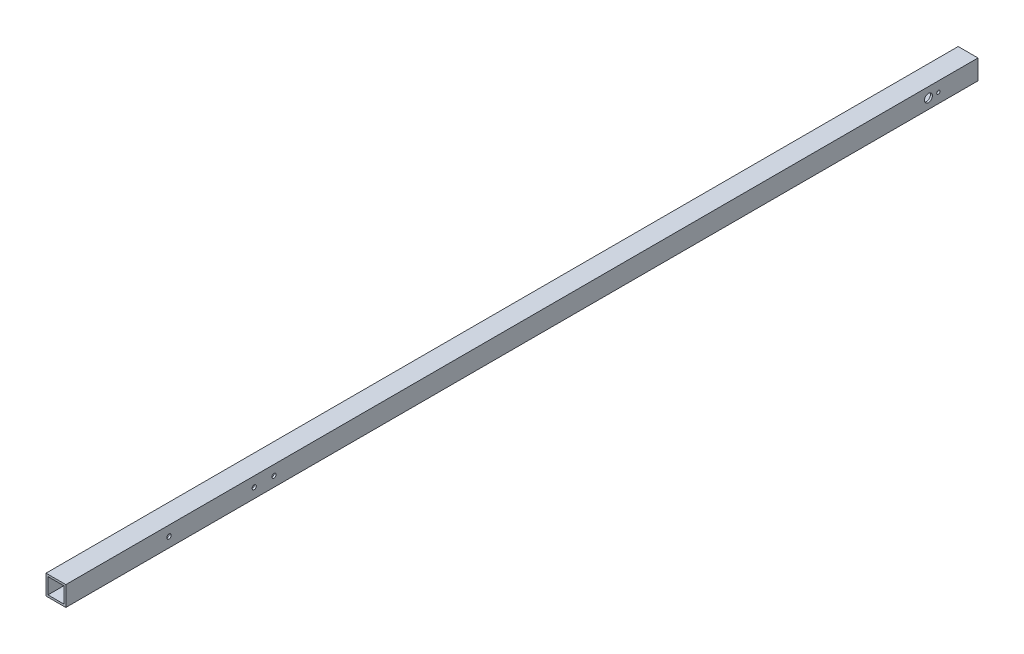
ISO-10303-21;
HEADER;
FILE_DESCRIPTION(('STEP AP214'),'2;1');
FILE_NAME('part.step','',(''),(''),'','','');
FILE_SCHEMA(('AUTOMOTIVE_DESIGN { 1 0 10303 214 1 1 1 1 }'));
ENDSEC;
DATA;
#1=APPLICATION_CONTEXT('core data for automotive mechanical design processes');
#2=APPLICATION_PROTOCOL_DEFINITION('international standard','automotive_design',2000,#1);
#3=PRODUCT_CONTEXT('',#1,'mechanical');
#4=PRODUCT('Part','Part','',(#3));
#5=PRODUCT_RELATED_PRODUCT_CATEGORY('part','',(#4));
#6=PRODUCT_DEFINITION_FORMATION('','',#4);
#7=PRODUCT_DEFINITION_CONTEXT('part definition',#1,'design');
#8=PRODUCT_DEFINITION('design','',#6,#7);
#9=PRODUCT_DEFINITION_SHAPE('','',#8);
#10=(LENGTH_UNIT() NAMED_UNIT(*) SI_UNIT(.MILLI.,.METRE.));
#11=(NAMED_UNIT(*) PLANE_ANGLE_UNIT() SI_UNIT($,.RADIAN.));
#12=(NAMED_UNIT(*) SI_UNIT($,.STERADIAN.) SOLID_ANGLE_UNIT());
#13=UNCERTAINTY_MEASURE_WITH_UNIT(LENGTH_MEASURE(1.E-05),#10,'distance_accuracy_value','');
#14=(GEOMETRIC_REPRESENTATION_CONTEXT(3) GLOBAL_UNCERTAINTY_ASSIGNED_CONTEXT((#13)) GLOBAL_UNIT_ASSIGNED_CONTEXT((#10,
#11,#12)) REPRESENTATION_CONTEXT('',''));
#15=CARTESIAN_POINT('',(0.,0.,0.));
#16=DIRECTION('',(0.,0.,1.));
#17=DIRECTION('',(1.,0.,0.));
#18=AXIS2_PLACEMENT_3D('',#15,#16,#17);
#19=CARTESIAN_POINT('',(0.,0.,0.));
#20=DIRECTION('',(0.,0.,1.));
#21=DIRECTION('',(1.,0.,0.));
#22=AXIS2_PLACEMENT_3D('',#19,#20,#21);
#23=PLANE('',#22);
#24=DIRECTION('',(0.,1.,0.));
#25=VECTOR('',#24,1.);
#26=CARTESIAN_POINT('',(10.,10.,0.));
#27=LINE('',#26,#25);
#28=CARTESIAN_POINT('',(10.,-10.,0.));
#29=VERTEX_POINT('',#28);
#30=CARTESIAN_POINT('',(10.,10.,0.));
#31=VERTEX_POINT('',#30);
#32=EDGE_CURVE('E127',#29,#31,#27,.T.);
#33=ORIENTED_EDGE('',*,*,#32,.F.);
#34=DIRECTION('',(1.,0.,0.));
#35=VECTOR('',#34,1.);
#36=CARTESIAN_POINT('',(-10.,-10.,0.));
#37=LINE('',#36,#35);
#38=CARTESIAN_POINT('',(-10.,-10.,0.));
#39=VERTEX_POINT('',#38);
#40=EDGE_CURVE('E136',#39,#29,#37,.T.);
#41=ORIENTED_EDGE('',*,*,#40,.F.);
#42=DIRECTION('',(0.,-1.,0.));
#43=VECTOR('',#42,1.);
#44=CARTESIAN_POINT('',(-10.,10.,0.));
#45=LINE('',#44,#43);
#46=CARTESIAN_POINT('',(-10.,10.,0.));
#47=VERTEX_POINT('',#46);
#48=EDGE_CURVE('E133',#47,#39,#45,.T.);
#49=ORIENTED_EDGE('',*,*,#48,.F.);
#50=DIRECTION('',(-1.,0.,0.));
#51=VECTOR('',#50,1.);
#52=CARTESIAN_POINT('',(-10.,10.,0.));
#53=LINE('',#52,#51);
#54=EDGE_CURVE('E130',#31,#47,#53,.T.);
#55=ORIENTED_EDGE('',*,*,#54,.F.);
#56=EDGE_LOOP('',(#33,#41,#49,#55));
#57=FACE_BOUND('',#56,.T.);
#58=DIRECTION('',(0.,1.,0.));
#59=VECTOR('',#58,1.);
#60=CARTESIAN_POINT('',(8.,8.,0.));
#61=LINE('',#60,#59);
#62=CARTESIAN_POINT('',(8.,-8.,0.));
#63=VERTEX_POINT('',#62);
#64=CARTESIAN_POINT('',(8.,8.,0.));
#65=VERTEX_POINT('',#64);
#66=EDGE_CURVE('E217',#63,#65,#61,.T.);
#67=ORIENTED_EDGE('',*,*,#66,.T.);
#68=DIRECTION('',(-1.,0.,0.));
#69=VECTOR('',#68,1.);
#70=CARTESIAN_POINT('',(-8.,8.,0.));
#71=LINE('',#70,#69);
#72=CARTESIAN_POINT('',(-8.,8.,0.));
#73=VERTEX_POINT('',#72);
#74=EDGE_CURVE('E220',#65,#73,#71,.T.);
#75=ORIENTED_EDGE('',*,*,#74,.T.);
#76=DIRECTION('',(0.,-1.,0.));
#77=VECTOR('',#76,1.);
#78=CARTESIAN_POINT('',(-8.,8.,0.));
#79=LINE('',#78,#77);
#80=CARTESIAN_POINT('',(-8.,-8.,0.));
#81=VERTEX_POINT('',#80);
#82=EDGE_CURVE('E223',#73,#81,#79,.T.);
#83=ORIENTED_EDGE('',*,*,#82,.T.);
#84=DIRECTION('',(1.,0.,0.));
#85=VECTOR('',#84,1.);
#86=CARTESIAN_POINT('',(-8.,-8.,0.));
#87=LINE('',#86,#85);
#88=EDGE_CURVE('E117',#81,#63,#87,.T.);
#89=ORIENTED_EDGE('',*,*,#88,.T.);
#90=EDGE_LOOP('',(#67,#75,#83,#89));
#91=FACE_BOUND('',#90,.T.);
#92=ADVANCED_FACE('F34',(#57,#91),#23,.F.);
#93=CARTESIAN_POINT('',(10.,10.,970.));
#94=DIRECTION('',(-1.,0.,0.));
#95=DIRECTION('',(0.,0.,1.));
#96=AXIS2_PLACEMENT_3D('',#93,#94,#95);
#97=PLANE('',#96);
#98=CARTESIAN_POINT('',(10.,0.,710.));
#99=DIRECTION('',(1.,0.,0.));
#100=DIRECTION('',(0.,0.,-1.));
#101=AXIS2_PLACEMENT_3D('',#98,#99,#100);
#102=CIRCLE('',#101,2.10000000000004);
#103=CARTESIAN_POINT('',(10.,0.,707.9));
#104=VERTEX_POINT('',#103);
#105=EDGE_CURVE('E465',#104,#104,#102,.T.);
#106=ORIENTED_EDGE('',*,*,#105,.F.);
#107=EDGE_LOOP('',(#106));
#108=FACE_BOUND('',#107,.T.);
#109=CARTESIAN_POINT('',(10.,0.,730.));
#110=DIRECTION('',(1.,0.,0.));
#111=DIRECTION('',(0.,0.,-1.));
#112=AXIS2_PLACEMENT_3D('',#109,#110,#111);
#113=CIRCLE('',#112,2.10000000000004);
#114=CARTESIAN_POINT('',(10.,0.,727.9));
#115=VERTEX_POINT('',#114);
#116=EDGE_CURVE('E173',#115,#115,#113,.T.);
#117=ORIENTED_EDGE('',*,*,#116,.F.);
#118=EDGE_LOOP('',(#117));
#119=FACE_BOUND('',#118,.T.);
#120=CARTESIAN_POINT('',(10.,0.,40.));
#121=DIRECTION('',(1.,0.,0.));
#122=DIRECTION('',(0.,0.,-1.));
#123=AXIS2_PLACEMENT_3D('',#120,#121,#122);
#124=CIRCLE('',#123,1.64999999999999);
#125=CARTESIAN_POINT('',(10.,0.,38.35));
#126=VERTEX_POINT('',#125);
#127=EDGE_CURVE('E166',#126,#126,#124,.T.);
#128=ORIENTED_EDGE('',*,*,#127,.F.);
#129=EDGE_LOOP('',(#128));
#130=FACE_BOUND('',#129,.T.);
#131=CARTESIAN_POINT('',(10.,0.,816.));
#132=DIRECTION('',(1.,0.,0.));
#133=DIRECTION('',(0.,0.,-1.));
#134=AXIS2_PLACEMENT_3D('',#131,#132,#133);
#135=CIRCLE('',#134,2.19999999999998);
#136=CARTESIAN_POINT('',(10.,0.,813.8));
#137=VERTEX_POINT('',#136);
#138=EDGE_CURVE('E155',#137,#137,#135,.T.);
#139=ORIENTED_EDGE('',*,*,#138,.F.);
#140=EDGE_LOOP('',(#139));
#141=FACE_BOUND('',#140,.T.);
#142=CARTESIAN_POINT('',(10.,0.,49.9999999999999));
#143=DIRECTION('',(1.,0.,0.));
#144=DIRECTION('',(0.,0.,-1.));
#145=AXIS2_PLACEMENT_3D('',#142,#143,#144);
#146=CIRCLE('',#145,4.05);
#147=CARTESIAN_POINT('',(10.,0.,45.9499999999999));
#148=VERTEX_POINT('',#147);
#149=EDGE_CURVE('E210',#148,#148,#146,.T.);
#150=ORIENTED_EDGE('',*,*,#149,.F.);
#151=EDGE_LOOP('',(#150));
#152=FACE_BOUND('',#151,.T.);
#153=DIRECTION('',(0.,0.,-1.));
#154=VECTOR('',#153,1.);
#155=CARTESIAN_POINT('',(10.,10.,970.));
#156=LINE('',#155,#154);
#157=CARTESIAN_POINT('',(10.,10.,920.));
#158=VERTEX_POINT('',#157);
#159=EDGE_CURVE('E43',#158,#31,#156,.T.);
#160=ORIENTED_EDGE('',*,*,#159,.F.);
#161=DIRECTION('',(0.,-1.,0.));
#162=VECTOR('',#161,1.);
#163=CARTESIAN_POINT('',(10.,10.,920.));
#164=LINE('',#163,#162);
#165=CARTESIAN_POINT('',(10.,-10.,920.));
#166=VERTEX_POINT('',#165);
#167=EDGE_CURVE('E207',#158,#166,#164,.T.);
#168=ORIENTED_EDGE('',*,*,#167,.T.);
#169=DIRECTION('',(0.,0.,-1.));
#170=VECTOR('',#169,1.);
#171=CARTESIAN_POINT('',(10.,-10.,970.));
#172=LINE('',#171,#170);
#173=EDGE_CURVE('E139',#166,#29,#172,.T.);
#174=ORIENTED_EDGE('',*,*,#173,.T.);
#175=ORIENTED_EDGE('',*,*,#32,.T.);
#176=EDGE_LOOP('',(#160,#168,#174,#175));
#177=FACE_BOUND('',#176,.T.);
#178=ADVANCED_FACE('F36',(#108,#119,#130,#141,#152,#177),#97,.F.);
#179=CARTESIAN_POINT('',(-10.,10.,970.));
#180=DIRECTION('',(0.,-1.,0.));
#181=DIRECTION('',(1.,0.,0.));
#182=AXIS2_PLACEMENT_3D('',#179,#180,#181);
#183=PLANE('',#182);
#184=DIRECTION('',(0.,0.,-1.));
#185=VECTOR('',#184,1.);
#186=CARTESIAN_POINT('',(-10.,10.,970.));
#187=LINE('',#186,#185);
#188=CARTESIAN_POINT('',(-10.,10.,920.));
#189=VERTEX_POINT('',#188);
#190=EDGE_CURVE('E143',#189,#47,#187,.T.);
#191=ORIENTED_EDGE('',*,*,#190,.F.);
#192=DIRECTION('',(1.,0.,0.));
#193=VECTOR('',#192,1.);
#194=CARTESIAN_POINT('',(-10.,10.,920.));
#195=LINE('',#194,#193);
#196=EDGE_CURVE('E204',#189,#158,#195,.T.);
#197=ORIENTED_EDGE('',*,*,#196,.T.);
#198=ORIENTED_EDGE('',*,*,#159,.T.);
#199=ORIENTED_EDGE('',*,*,#54,.T.);
#200=EDGE_LOOP('',(#191,#197,#198,#199));
#201=FACE_BOUND('',#200,.T.);
#202=ADVANCED_FACE('F248',(#201),#183,.F.);
#203=CARTESIAN_POINT('',(-10.,10.,970.));
#204=DIRECTION('',(1.,0.,0.));
#205=DIRECTION('',(0.,0.,-1.));
#206=AXIS2_PLACEMENT_3D('',#203,#204,#205);
#207=PLANE('',#206);
#208=CARTESIAN_POINT('',(-10.,0.,710.));
#209=DIRECTION('',(1.,0.,0.));
#210=DIRECTION('',(0.,0.,-1.));
#211=AXIS2_PLACEMENT_3D('',#208,#209,#210);
#212=CIRCLE('',#211,2.10000000000004);
#213=CARTESIAN_POINT('',(-10.,0.,707.9));
#214=VERTEX_POINT('',#213);
#215=EDGE_CURVE('E159',#214,#214,#212,.T.);
#216=ORIENTED_EDGE('',*,*,#215,.T.);
#217=EDGE_LOOP('',(#216));
#218=FACE_BOUND('',#217,.T.);
#219=CARTESIAN_POINT('',(-10.,0.,730.));
#220=DIRECTION('',(1.,0.,0.));
#221=DIRECTION('',(0.,0.,-1.));
#222=AXIS2_PLACEMENT_3D('',#219,#220,#221);
#223=CIRCLE('',#222,2.10000000000004);
#224=CARTESIAN_POINT('',(-10.,0.,727.9));
#225=VERTEX_POINT('',#224);
#226=EDGE_CURVE('E467',#225,#225,#223,.T.);
#227=ORIENTED_EDGE('',*,*,#226,.T.);
#228=EDGE_LOOP('',(#227));
#229=FACE_BOUND('',#228,.T.);
#230=CARTESIAN_POINT('',(-10.,0.,816.));
#231=DIRECTION('',(1.,0.,0.));
#232=DIRECTION('',(0.,0.,-1.));
#233=AXIS2_PLACEMENT_3D('',#230,#231,#232);
#234=CIRCLE('',#233,2.19999999999998);
#235=CARTESIAN_POINT('',(-10.,0.,813.8));
#236=VERTEX_POINT('',#235);
#237=EDGE_CURVE('E113',#236,#236,#234,.T.);
#238=ORIENTED_EDGE('',*,*,#237,.T.);
#239=EDGE_LOOP('',(#238));
#240=FACE_BOUND('',#239,.T.);
#241=CARTESIAN_POINT('',(-10.,0.,49.9999999999999));
#242=DIRECTION('',(1.,0.,0.));
#243=DIRECTION('',(0.,0.,-1.));
#244=AXIS2_PLACEMENT_3D('',#241,#242,#243);
#245=CIRCLE('',#244,4.05);
#246=CARTESIAN_POINT('',(-10.,0.,45.9499999999999));
#247=VERTEX_POINT('',#246);
#248=EDGE_CURVE('E149',#247,#247,#245,.T.);
#249=ORIENTED_EDGE('',*,*,#248,.T.);
#250=EDGE_LOOP('',(#249));
#251=FACE_BOUND('',#250,.T.);
#252=DIRECTION('',(0.,0.,-1.));
#253=VECTOR('',#252,1.);
#254=CARTESIAN_POINT('',(-10.,-10.,970.));
#255=LINE('',#254,#253);
#256=CARTESIAN_POINT('',(-10.,-10.,920.));
#257=VERTEX_POINT('',#256);
#258=EDGE_CURVE('E141',#257,#39,#255,.T.);
#259=ORIENTED_EDGE('',*,*,#258,.F.);
#260=DIRECTION('',(0.,1.,0.));
#261=VECTOR('',#260,1.);
#262=CARTESIAN_POINT('',(-10.,10.,920.));
#263=LINE('',#262,#261);
#264=EDGE_CURVE('E51',#257,#189,#263,.T.);
#265=ORIENTED_EDGE('',*,*,#264,.T.);
#266=ORIENTED_EDGE('',*,*,#190,.T.);
#267=ORIENTED_EDGE('',*,*,#48,.T.);
#268=EDGE_LOOP('',(#259,#265,#266,#267));
#269=FACE_BOUND('',#268,.T.);
#270=ADVANCED_FACE('F261',(#218,#229,#240,#251,#269),#207,.F.);
#271=CARTESIAN_POINT('',(-10.,-10.,970.));
#272=DIRECTION('',(0.,1.,0.));
#273=DIRECTION('',(0.,0.,1.));
#274=AXIS2_PLACEMENT_3D('',#271,#272,#273);
#275=PLANE('',#274);
#276=CARTESIAN_POINT('',(0.,-10.,670.));
#277=DIRECTION('',(0.,-1.,0.));
#278=DIRECTION('',(0.,0.,-1.));
#279=AXIS2_PLACEMENT_3D('',#276,#277,#278);
#280=CIRCLE('',#279,1.64999999999999);
#281=CARTESIAN_POINT('',(0.,-10.,668.35));
#282=VERTEX_POINT('',#281);
#283=EDGE_CURVE('E454',#282,#282,#280,.T.);
#284=ORIENTED_EDGE('',*,*,#283,.F.);
#285=EDGE_LOOP('',(#284));
#286=FACE_BOUND('',#285,.T.);
#287=CARTESIAN_POINT('',(0.,-10.,650.));
#288=DIRECTION('',(0.,-1.,0.));
#289=DIRECTION('',(0.,0.,-1.));
#290=AXIS2_PLACEMENT_3D('',#287,#288,#289);
#291=CIRCLE('',#290,1.64999999999999);
#292=CARTESIAN_POINT('',(0.,-10.,648.35));
#293=VERTEX_POINT('',#292);
#294=EDGE_CURVE('E456',#293,#293,#291,.T.);
#295=ORIENTED_EDGE('',*,*,#294,.F.);
#296=EDGE_LOOP('',(#295));
#297=FACE_BOUND('',#296,.T.);
#298=CARTESIAN_POINT('',(0.,-10.,30.));
#299=DIRECTION('',(0.,-1.,0.));
#300=DIRECTION('',(0.,0.,-1.));
#301=AXIS2_PLACEMENT_3D('',#298,#299,#300);
#302=CIRCLE('',#301,1.64999999999999);
#303=CARTESIAN_POINT('',(0.,-10.,28.35));
#304=VERTEX_POINT('',#303);
#305=EDGE_CURVE('E181',#304,#304,#302,.T.);
#306=ORIENTED_EDGE('',*,*,#305,.F.);
#307=EDGE_LOOP('',(#306));
#308=FACE_BOUND('',#307,.T.);
#309=CARTESIAN_POINT('',(0.,-10.,50.));
#310=DIRECTION('',(0.,-1.,0.));
#311=DIRECTION('',(0.,0.,-1.));
#312=AXIS2_PLACEMENT_3D('',#309,#310,#311);
#313=CIRCLE('',#312,1.64999999999999);
#314=CARTESIAN_POINT('',(0.,-10.,48.35));
#315=VERTEX_POINT('',#314);
#316=EDGE_CURVE('E187',#315,#315,#313,.T.);
#317=ORIENTED_EDGE('',*,*,#316,.F.);
#318=EDGE_LOOP('',(#317));
#319=FACE_BOUND('',#318,.T.);
#320=ORIENTED_EDGE('',*,*,#173,.F.);
#321=DIRECTION('',(-1.,0.,0.));
#322=VECTOR('',#321,1.);
#323=CARTESIAN_POINT('',(-10.,-10.,920.));
#324=LINE('',#323,#322);
#325=EDGE_CURVE('E201',#166,#257,#324,.T.);
#326=ORIENTED_EDGE('',*,*,#325,.T.);
#327=ORIENTED_EDGE('',*,*,#258,.T.);
#328=ORIENTED_EDGE('',*,*,#40,.T.);
#329=EDGE_LOOP('',(#320,#326,#327,#328));
#330=FACE_BOUND('',#329,.T.);
#331=ADVANCED_FACE('F234',(#286,#297,#308,#319,#330),#275,.F.);
#332=CARTESIAN_POINT('',(8.,8.,970.));
#333=DIRECTION('',(-1.,0.,0.));
#334=DIRECTION('',(0.,-1.,0.));
#335=AXIS2_PLACEMENT_3D('',#332,#333,#334);
#336=PLANE('',#335);
#337=CARTESIAN_POINT('',(8.,0.,710.));
#338=DIRECTION('',(-1.,0.,0.));
#339=DIRECTION('',(0.,-1.,0.));
#340=AXIS2_PLACEMENT_3D('',#337,#338,#339);
#341=CIRCLE('',#340,2.10000000000004);
#342=CARTESIAN_POINT('',(8.,-2.10000000000004,710.));
#343=VERTEX_POINT('',#342);
#344=EDGE_CURVE('E162',#343,#343,#341,.T.);
#345=ORIENTED_EDGE('',*,*,#344,.F.);
#346=EDGE_LOOP('',(#345));
#347=FACE_BOUND('',#346,.T.);
#348=CARTESIAN_POINT('',(8.,0.,730.));
#349=DIRECTION('',(-1.,0.,0.));
#350=DIRECTION('',(0.,-1.,0.));
#351=AXIS2_PLACEMENT_3D('',#348,#349,#350);
#352=CIRCLE('',#351,2.10000000000004);
#353=CARTESIAN_POINT('',(8.,-2.10000000000004,730.));
#354=VERTEX_POINT('',#353);
#355=EDGE_CURVE('E158',#354,#354,#352,.T.);
#356=ORIENTED_EDGE('',*,*,#355,.F.);
#357=EDGE_LOOP('',(#356));
#358=FACE_BOUND('',#357,.T.);
#359=CARTESIAN_POINT('',(8.,0.,40.));
#360=DIRECTION('',(-1.,0.,0.));
#361=DIRECTION('',(0.,-1.,0.));
#362=AXIS2_PLACEMENT_3D('',#359,#360,#361);
#363=CIRCLE('',#362,1.64999999999999);
#364=CARTESIAN_POINT('',(8.,-1.64999999999999,40.));
#365=VERTEX_POINT('',#364);
#366=EDGE_CURVE('E178',#365,#365,#363,.T.);
#367=ORIENTED_EDGE('',*,*,#366,.F.);
#368=EDGE_LOOP('',(#367));
#369=FACE_BOUND('',#368,.T.);
#370=CARTESIAN_POINT('',(8.,0.,816.));
#371=DIRECTION('',(-1.,0.,0.));
#372=DIRECTION('',(0.,-1.,0.));
#373=AXIS2_PLACEMENT_3D('',#370,#371,#372);
#374=CIRCLE('',#373,2.19999999999998);
#375=CARTESIAN_POINT('',(8.,-2.2,816.));
#376=VERTEX_POINT('',#375);
#377=EDGE_CURVE('E154',#376,#376,#374,.T.);
#378=ORIENTED_EDGE('',*,*,#377,.F.);
#379=EDGE_LOOP('',(#378));
#380=FACE_BOUND('',#379,.T.);
#381=DIRECTION('',(0.,-1.,0.));
#382=VECTOR('',#381,1.);
#383=CARTESIAN_POINT('',(8.,8.,920.));
#384=LINE('',#383,#382);
#385=CARTESIAN_POINT('',(8.,8.,920.));
#386=VERTEX_POINT('',#385);
#387=CARTESIAN_POINT('',(8.,-8.,920.));
#388=VERTEX_POINT('',#387);
#389=EDGE_CURVE('E58',#386,#388,#384,.T.);
#390=ORIENTED_EDGE('',*,*,#389,.F.);
#391=DIRECTION('',(0.,0.,-1.));
#392=VECTOR('',#391,1.);
#393=CARTESIAN_POINT('',(8.,8.,970.));
#394=LINE('',#393,#392);
#395=EDGE_CURVE('E121',#386,#65,#394,.T.);
#396=ORIENTED_EDGE('',*,*,#395,.T.);
#397=ORIENTED_EDGE('',*,*,#66,.F.);
#398=DIRECTION('',(0.,0.,-1.));
#399=VECTOR('',#398,1.);
#400=CARTESIAN_POINT('',(8.,-8.,970.));
#401=LINE('',#400,#399);
#402=EDGE_CURVE('E119',#388,#63,#401,.T.);
#403=ORIENTED_EDGE('',*,*,#402,.F.);
#404=EDGE_LOOP('',(#390,#396,#397,#403));
#405=FACE_BOUND('',#404,.T.);
#406=CARTESIAN_POINT('',(8.,0.,49.9999999999999));
#407=DIRECTION('',(-1.,0.,0.));
#408=DIRECTION('',(0.,-1.,0.));
#409=AXIS2_PLACEMENT_3D('',#406,#407,#408);
#410=CIRCLE('',#409,4.05);
#411=CARTESIAN_POINT('',(8.,-4.05,49.9999999999999));
#412=VERTEX_POINT('',#411);
#413=EDGE_CURVE('E148',#412,#412,#410,.T.);
#414=ORIENTED_EDGE('',*,*,#413,.F.);
#415=EDGE_LOOP('',(#414));
#416=FACE_BOUND('',#415,.T.);
#417=ADVANCED_FACE('F231',(#347,#358,#369,#380,#405,#416),#336,.T.);
#418=CARTESIAN_POINT('',(-8.,8.,970.));
#419=DIRECTION('',(0.,-1.,0.));
#420=DIRECTION('',(0.,0.,-1.));
#421=AXIS2_PLACEMENT_3D('',#418,#419,#420);
#422=PLANE('',#421);
#423=DIRECTION('',(1.,0.,0.));
#424=VECTOR('',#423,1.);
#425=CARTESIAN_POINT('',(-8.,8.,920.));
#426=LINE('',#425,#424);
#427=CARTESIAN_POINT('',(-8.,8.,920.));
#428=VERTEX_POINT('',#427);
#429=EDGE_CURVE('E112',#428,#386,#426,.T.);
#430=ORIENTED_EDGE('',*,*,#429,.F.);
#431=DIRECTION('',(0.,0.,-1.));
#432=VECTOR('',#431,1.);
#433=CARTESIAN_POINT('',(-8.,8.,970.));
#434=LINE('',#433,#432);
#435=EDGE_CURVE('E111',#428,#73,#434,.T.);
#436=ORIENTED_EDGE('',*,*,#435,.T.);
#437=ORIENTED_EDGE('',*,*,#74,.F.);
#438=ORIENTED_EDGE('',*,*,#395,.F.);
#439=EDGE_LOOP('',(#430,#436,#437,#438));
#440=FACE_BOUND('',#439,.T.);
#441=ADVANCED_FACE('F229',(#440),#422,.T.);
#442=CARTESIAN_POINT('',(-8.,8.,970.));
#443=DIRECTION('',(1.,0.,0.));
#444=DIRECTION('',(0.,0.,-1.));
#445=AXIS2_PLACEMENT_3D('',#442,#443,#444);
#446=PLANE('',#445);
#447=CARTESIAN_POINT('',(-8.,0.,710.));
#448=DIRECTION('',(1.,0.,0.));
#449=DIRECTION('',(0.,0.,-1.));
#450=AXIS2_PLACEMENT_3D('',#447,#448,#449);
#451=CIRCLE('',#450,2.10000000000004);
#452=CARTESIAN_POINT('',(-8.,0.,707.9));
#453=VERTEX_POINT('',#452);
#454=EDGE_CURVE('E160',#453,#453,#451,.T.);
#455=ORIENTED_EDGE('',*,*,#454,.F.);
#456=EDGE_LOOP('',(#455));
#457=FACE_BOUND('',#456,.T.);
#458=CARTESIAN_POINT('',(-8.,0.,730.));
#459=DIRECTION('',(1.,0.,0.));
#460=DIRECTION('',(0.,0.,-1.));
#461=AXIS2_PLACEMENT_3D('',#458,#459,#460);
#462=CIRCLE('',#461,2.10000000000004);
#463=CARTESIAN_POINT('',(-8.,0.,727.9));
#464=VERTEX_POINT('',#463);
#465=EDGE_CURVE('E156',#464,#464,#462,.T.);
#466=ORIENTED_EDGE('',*,*,#465,.F.);
#467=EDGE_LOOP('',(#466));
#468=FACE_BOUND('',#467,.T.);
#469=CARTESIAN_POINT('',(-8.,0.,816.));
#470=DIRECTION('',(1.,0.,0.));
#471=DIRECTION('',(0.,0.,-1.));
#472=AXIS2_PLACEMENT_3D('',#469,#470,#471);
#473=CIRCLE('',#472,2.19999999999998);
#474=CARTESIAN_POINT('',(-8.,0.,813.8));
#475=VERTEX_POINT('',#474);
#476=EDGE_CURVE('E151',#475,#475,#473,.T.);
#477=ORIENTED_EDGE('',*,*,#476,.F.);
#478=EDGE_LOOP('',(#477));
#479=FACE_BOUND('',#478,.T.);
#480=DIRECTION('',(0.,1.,0.));
#481=VECTOR('',#480,1.);
#482=CARTESIAN_POINT('',(-8.,8.,920.));
#483=LINE('',#482,#481);
#484=CARTESIAN_POINT('',(-8.,-8.,920.));
#485=VERTEX_POINT('',#484);
#486=EDGE_CURVE('E99',#485,#428,#483,.T.);
#487=ORIENTED_EDGE('',*,*,#486,.F.);
#488=DIRECTION('',(0.,0.,-1.));
#489=VECTOR('',#488,1.);
#490=CARTESIAN_POINT('',(-8.,-8.,970.));
#491=LINE('',#490,#489);
#492=EDGE_CURVE('E109',#485,#81,#491,.T.);
#493=ORIENTED_EDGE('',*,*,#492,.T.);
#494=ORIENTED_EDGE('',*,*,#82,.F.);
#495=ORIENTED_EDGE('',*,*,#435,.F.);
#496=EDGE_LOOP('',(#487,#493,#494,#495));
#497=FACE_BOUND('',#496,.T.);
#498=CARTESIAN_POINT('',(-8.,0.,49.9999999999999));
#499=DIRECTION('',(1.,0.,0.));
#500=DIRECTION('',(0.,0.,-1.));
#501=AXIS2_PLACEMENT_3D('',#498,#499,#500);
#502=CIRCLE('',#501,4.05);
#503=CARTESIAN_POINT('',(-8.,0.,45.9499999999999));
#504=VERTEX_POINT('',#503);
#505=EDGE_CURVE('E146',#504,#504,#502,.T.);
#506=ORIENTED_EDGE('',*,*,#505,.F.);
#507=EDGE_LOOP('',(#506));
#508=FACE_BOUND('',#507,.T.);
#509=ADVANCED_FACE('F106',(#457,#468,#479,#497,#508),#446,.T.);
#510=CARTESIAN_POINT('',(-8.,-8.,970.));
#511=DIRECTION('',(0.,1.,0.));
#512=DIRECTION('',(0.,0.,1.));
#513=AXIS2_PLACEMENT_3D('',#510,#511,#512);
#514=PLANE('',#513);
#515=CARTESIAN_POINT('',(0.,-8.,670.));
#516=DIRECTION('',(0.,1.,0.));
#517=DIRECTION('',(0.,0.,1.));
#518=AXIS2_PLACEMENT_3D('',#515,#516,#517);
#519=CIRCLE('',#518,1.64999999999999);
#520=CARTESIAN_POINT('',(0.,-8.,671.65));
#521=VERTEX_POINT('',#520);
#522=EDGE_CURVE('E38',#521,#521,#519,.T.);
#523=ORIENTED_EDGE('',*,*,#522,.F.);
#524=EDGE_LOOP('',(#523));
#525=FACE_BOUND('',#524,.T.);
#526=CARTESIAN_POINT('',(0.,-8.,650.));
#527=DIRECTION('',(0.,1.,0.));
#528=DIRECTION('',(0.,0.,1.));
#529=AXIS2_PLACEMENT_3D('',#526,#527,#528);
#530=CIRCLE('',#529,1.64999999999999);
#531=CARTESIAN_POINT('',(0.,-8.,651.65));
#532=VERTEX_POINT('',#531);
#533=EDGE_CURVE('E460',#532,#532,#530,.T.);
#534=ORIENTED_EDGE('',*,*,#533,.F.);
#535=EDGE_LOOP('',(#534));
#536=FACE_BOUND('',#535,.T.);
#537=CARTESIAN_POINT('',(0.,-8.,30.));
#538=DIRECTION('',(0.,1.,0.));
#539=DIRECTION('',(0.,0.,1.));
#540=AXIS2_PLACEMENT_3D('',#537,#538,#539);
#541=CIRCLE('',#540,1.64999999999999);
#542=CARTESIAN_POINT('',(0.,-8.,31.65));
#543=VERTEX_POINT('',#542);
#544=EDGE_CURVE('E184',#543,#543,#541,.T.);
#545=ORIENTED_EDGE('',*,*,#544,.F.);
#546=EDGE_LOOP('',(#545));
#547=FACE_BOUND('',#546,.T.);
#548=CARTESIAN_POINT('',(0.,-8.,50.));
#549=DIRECTION('',(0.,1.,0.));
#550=DIRECTION('',(0.,0.,1.));
#551=AXIS2_PLACEMENT_3D('',#548,#549,#550);
#552=CIRCLE('',#551,1.64999999999999);
#553=CARTESIAN_POINT('',(0.,-8.,51.65));
#554=VERTEX_POINT('',#553);
#555=EDGE_CURVE('E190',#554,#554,#552,.T.);
#556=ORIENTED_EDGE('',*,*,#555,.F.);
#557=EDGE_LOOP('',(#556));
#558=FACE_BOUND('',#557,.T.);
#559=DIRECTION('',(-1.,0.,0.));
#560=VECTOR('',#559,1.);
#561=CARTESIAN_POINT('',(-8.,-8.,920.));
#562=LINE('',#561,#560);
#563=EDGE_CURVE('E11',#388,#485,#562,.T.);
#564=ORIENTED_EDGE('',*,*,#563,.F.);
#565=ORIENTED_EDGE('',*,*,#402,.T.);
#566=ORIENTED_EDGE('',*,*,#88,.F.);
#567=ORIENTED_EDGE('',*,*,#492,.F.);
#568=EDGE_LOOP('',(#564,#565,#566,#567));
#569=FACE_BOUND('',#568,.T.);
#570=ADVANCED_FACE('F115',(#525,#536,#547,#558,#569),#514,.T.);
#571=CARTESIAN_POINT('',(-10.,0.,49.9999999999999));
#572=DIRECTION('',(1.,0.,0.));
#573=DIRECTION('',(0.,0.,-1.));
#574=AXIS2_PLACEMENT_3D('',#571,#572,#573);
#575=CYLINDRICAL_SURFACE('',#574,4.05);
#576=ORIENTED_EDGE('',*,*,#505,.T.);
#577=EDGE_LOOP('',(#576));
#578=FACE_BOUND('',#577,.T.);
#579=ORIENTED_EDGE('',*,*,#248,.F.);
#580=EDGE_LOOP('',(#579));
#581=FACE_BOUND('',#580,.T.);
#582=ADVANCED_FACE('F242',(#578,#581),#575,.F.);
#583=ORIENTED_EDGE('',*,*,#413,.T.);
#584=EDGE_LOOP('',(#583));
#585=FACE_BOUND('',#584,.T.);
#586=ORIENTED_EDGE('',*,*,#149,.T.);
#587=EDGE_LOOP('',(#586));
#588=FACE_BOUND('',#587,.T.);
#589=ADVANCED_FACE('F239',(#585,#588),#575,.F.);
#590=CARTESIAN_POINT('',(0.,0.,920.));
#591=DIRECTION('',(0.,0.,-1.));
#592=DIRECTION('',(-1.,0.,0.));
#593=AXIS2_PLACEMENT_3D('',#590,#591,#592);
#594=PLANE('',#593);
#595=ORIENTED_EDGE('',*,*,#389,.T.);
#596=ORIENTED_EDGE('',*,*,#563,.T.);
#597=ORIENTED_EDGE('',*,*,#486,.T.);
#598=ORIENTED_EDGE('',*,*,#429,.T.);
#599=EDGE_LOOP('',(#595,#596,#597,#598));
#600=FACE_BOUND('',#599,.T.);
#601=ORIENTED_EDGE('',*,*,#196,.F.);
#602=ORIENTED_EDGE('',*,*,#264,.F.);
#603=ORIENTED_EDGE('',*,*,#325,.F.);
#604=ORIENTED_EDGE('',*,*,#167,.F.);
#605=EDGE_LOOP('',(#601,#602,#603,#604));
#606=FACE_BOUND('',#605,.T.);
#607=ADVANCED_FACE('F98',(#600,#606),#594,.F.);
#608=CARTESIAN_POINT('',(-20.,0.,816.));
#609=DIRECTION('',(1.,0.,0.));
#610=DIRECTION('',(0.,0.,-1.));
#611=AXIS2_PLACEMENT_3D('',#608,#609,#610);
#612=CYLINDRICAL_SURFACE('',#611,2.19999999999998);
#613=ORIENTED_EDGE('',*,*,#476,.T.);
#614=EDGE_LOOP('',(#613));
#615=FACE_BOUND('',#614,.T.);
#616=ORIENTED_EDGE('',*,*,#237,.F.);
#617=EDGE_LOOP('',(#616));
#618=FACE_BOUND('',#617,.T.);
#619=ADVANCED_FACE('F264',(#615,#618),#612,.F.);
#620=ORIENTED_EDGE('',*,*,#377,.T.);
#621=EDGE_LOOP('',(#620));
#622=FACE_BOUND('',#621,.T.);
#623=ORIENTED_EDGE('',*,*,#138,.T.);
#624=EDGE_LOOP('',(#623));
#625=FACE_BOUND('',#624,.T.);
#626=ADVANCED_FACE('F269',(#622,#625),#612,.F.);
#627=CARTESIAN_POINT('',(0.,-10.,50.));
#628=DIRECTION('',(0.,-1.,0.));
#629=DIRECTION('',(0.,0.,-1.));
#630=AXIS2_PLACEMENT_3D('',#627,#628,#629);
#631=CYLINDRICAL_SURFACE('',#630,1.64999999999999);
#632=ORIENTED_EDGE('',*,*,#555,.T.);
#633=EDGE_LOOP('',(#632));
#634=FACE_BOUND('',#633,.T.);
#635=ORIENTED_EDGE('',*,*,#316,.T.);
#636=EDGE_LOOP('',(#635));
#637=FACE_BOUND('',#636,.T.);
#638=ADVANCED_FACE('F353',(#634,#637),#631,.F.);
#639=CARTESIAN_POINT('',(0.,-10.,30.));
#640=DIRECTION('',(0.,-1.,0.));
#641=DIRECTION('',(0.,0.,-1.));
#642=AXIS2_PLACEMENT_3D('',#639,#640,#641);
#643=CYLINDRICAL_SURFACE('',#642,1.64999999999999);
#644=ORIENTED_EDGE('',*,*,#544,.T.);
#645=EDGE_LOOP('',(#644));
#646=FACE_BOUND('',#645,.T.);
#647=ORIENTED_EDGE('',*,*,#305,.T.);
#648=EDGE_LOOP('',(#647));
#649=FACE_BOUND('',#648,.T.);
#650=ADVANCED_FACE('F361',(#646,#649),#643,.F.);
#651=CARTESIAN_POINT('',(10.,0.,40.));
#652=DIRECTION('',(1.,0.,0.));
#653=DIRECTION('',(0.,0.,-1.));
#654=AXIS2_PLACEMENT_3D('',#651,#652,#653);
#655=CYLINDRICAL_SURFACE('',#654,1.64999999999999);
#656=ORIENTED_EDGE('',*,*,#366,.T.);
#657=EDGE_LOOP('',(#656));
#658=FACE_BOUND('',#657,.T.);
#659=ORIENTED_EDGE('',*,*,#127,.T.);
#660=EDGE_LOOP('',(#659));
#661=FACE_BOUND('',#660,.T.);
#662=ADVANCED_FACE('F371',(#658,#661),#655,.F.);
#663=CARTESIAN_POINT('',(-10.,0.,730.));
#664=DIRECTION('',(1.,0.,0.));
#665=DIRECTION('',(0.,0.,-1.));
#666=AXIS2_PLACEMENT_3D('',#663,#664,#665);
#667=CYLINDRICAL_SURFACE('',#666,2.10000000000004);
#668=ORIENTED_EDGE('',*,*,#465,.T.);
#669=EDGE_LOOP('',(#668));
#670=FACE_BOUND('',#669,.T.);
#671=ORIENTED_EDGE('',*,*,#226,.F.);
#672=EDGE_LOOP('',(#671));
#673=FACE_BOUND('',#672,.T.);
#674=ADVANCED_FACE('F381',(#670,#673),#667,.F.);
#675=CARTESIAN_POINT('',(-10.,0.,710.));
#676=DIRECTION('',(1.,0.,0.));
#677=DIRECTION('',(0.,0.,-1.));
#678=AXIS2_PLACEMENT_3D('',#675,#676,#677);
#679=CYLINDRICAL_SURFACE('',#678,2.10000000000004);
#680=ORIENTED_EDGE('',*,*,#454,.T.);
#681=EDGE_LOOP('',(#680));
#682=FACE_BOUND('',#681,.T.);
#683=ORIENTED_EDGE('',*,*,#215,.F.);
#684=EDGE_LOOP('',(#683));
#685=FACE_BOUND('',#684,.T.);
#686=ADVANCED_FACE('F390',(#682,#685),#679,.F.);
#687=ORIENTED_EDGE('',*,*,#355,.T.);
#688=EDGE_LOOP('',(#687));
#689=FACE_BOUND('',#688,.T.);
#690=ORIENTED_EDGE('',*,*,#116,.T.);
#691=EDGE_LOOP('',(#690));
#692=FACE_BOUND('',#691,.T.);
#693=ADVANCED_FACE('F393',(#689,#692),#667,.F.);
#694=ORIENTED_EDGE('',*,*,#344,.T.);
#695=EDGE_LOOP('',(#694));
#696=FACE_BOUND('',#695,.T.);
#697=ORIENTED_EDGE('',*,*,#105,.T.);
#698=EDGE_LOOP('',(#697));
#699=FACE_BOUND('',#698,.T.);
#700=ADVANCED_FACE('F401',(#696,#699),#679,.F.);
#701=CARTESIAN_POINT('',(0.,-10.,650.));
#702=DIRECTION('',(0.,-1.,0.));
#703=DIRECTION('',(0.,0.,-1.));
#704=AXIS2_PLACEMENT_3D('',#701,#702,#703);
#705=CYLINDRICAL_SURFACE('',#704,1.64999999999999);
#706=ORIENTED_EDGE('',*,*,#533,.T.);
#707=EDGE_LOOP('',(#706));
#708=FACE_BOUND('',#707,.T.);
#709=ORIENTED_EDGE('',*,*,#294,.T.);
#710=EDGE_LOOP('',(#709));
#711=FACE_BOUND('',#710,.T.);
#712=ADVANCED_FACE('F413',(#708,#711),#705,.F.);
#713=CARTESIAN_POINT('',(0.,-10.,670.));
#714=DIRECTION('',(0.,-1.,0.));
#715=DIRECTION('',(0.,0.,-1.));
#716=AXIS2_PLACEMENT_3D('',#713,#714,#715);
#717=CYLINDRICAL_SURFACE('',#716,1.64999999999999);
#718=ORIENTED_EDGE('',*,*,#522,.T.);
#719=EDGE_LOOP('',(#718));
#720=FACE_BOUND('',#719,.T.);
#721=ORIENTED_EDGE('',*,*,#283,.T.);
#722=EDGE_LOOP('',(#721));
#723=FACE_BOUND('',#722,.T.);
#724=ADVANCED_FACE('F420',(#720,#723),#717,.F.);
#725=CLOSED_SHELL('',(#92,#178,#202,#270,#331,#417,#441,#509,#570,#582,#589,#607,#619,#626,#638,
#650,#662,#674,#686,#693,#700,#712,#724));
#726=MANIFOLD_SOLID_BREP('B2',#725);
#727=ADVANCED_BREP_SHAPE_REPRESENTATION('',(#18,#726),#14);
#728=SHAPE_DEFINITION_REPRESENTATION(#9,#727);
ENDSEC;
END-ISO-10303-21;
